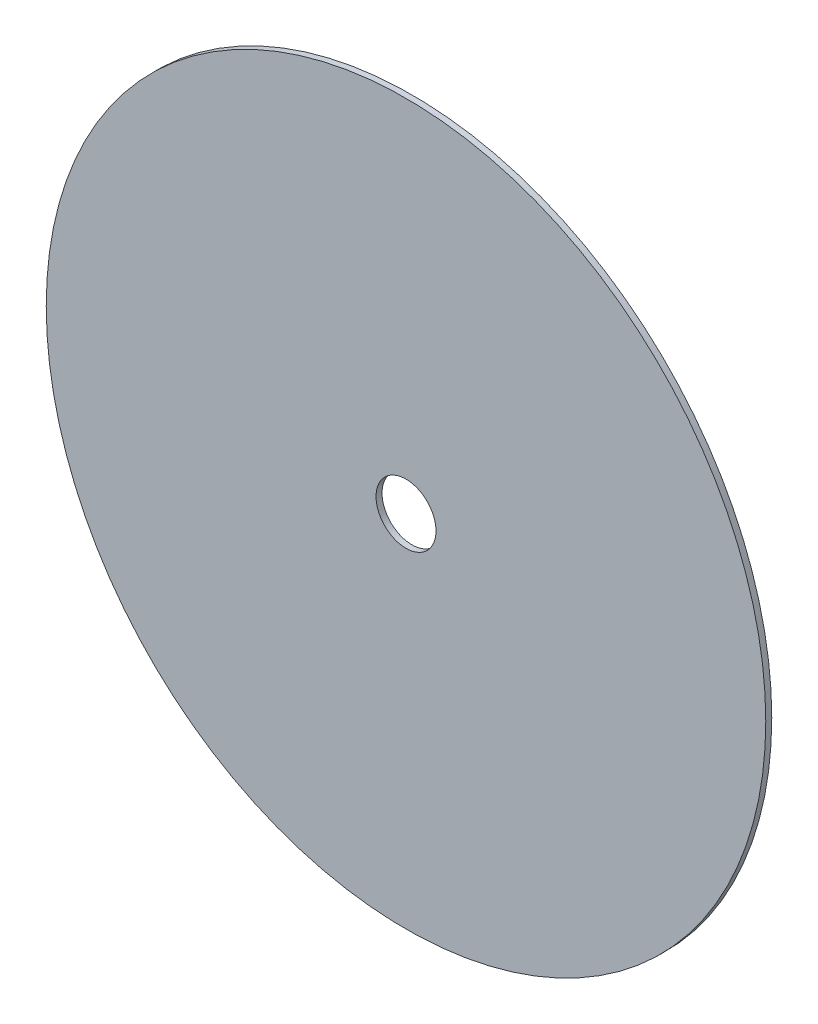
ISO-10303-21;
HEADER;
FILE_DESCRIPTION(('STEP AP214'),'2;1');
FILE_NAME('part.step','',(''),(''),'','','');
FILE_SCHEMA(('AUTOMOTIVE_DESIGN { 1 0 10303 214 1 1 1 1 }'));
ENDSEC;
DATA;
#1=APPLICATION_CONTEXT('core data for automotive mechanical design processes');
#2=APPLICATION_PROTOCOL_DEFINITION('international standard','automotive_design',2000,#1);
#3=PRODUCT_CONTEXT('',#1,'mechanical');
#4=PRODUCT('Part','Part','',(#3));
#5=PRODUCT_RELATED_PRODUCT_CATEGORY('part','',(#4));
#6=PRODUCT_DEFINITION_FORMATION('','',#4);
#7=PRODUCT_DEFINITION_CONTEXT('part definition',#1,'design');
#8=PRODUCT_DEFINITION('design','',#6,#7);
#9=PRODUCT_DEFINITION_SHAPE('','',#8);
#10=(LENGTH_UNIT() NAMED_UNIT(*) SI_UNIT(.MILLI.,.METRE.));
#11=(NAMED_UNIT(*) PLANE_ANGLE_UNIT() SI_UNIT($,.RADIAN.));
#12=(NAMED_UNIT(*) SI_UNIT($,.STERADIAN.) SOLID_ANGLE_UNIT());
#13=UNCERTAINTY_MEASURE_WITH_UNIT(LENGTH_MEASURE(1.E-05),#10,'distance_accuracy_value','');
#14=(GEOMETRIC_REPRESENTATION_CONTEXT(3) GLOBAL_UNCERTAINTY_ASSIGNED_CONTEXT((#13)) GLOBAL_UNIT_ASSIGNED_CONTEXT((#10,
#11,#12)) REPRESENTATION_CONTEXT('',''));
#15=CARTESIAN_POINT('',(0.,0.,0.));
#16=DIRECTION('',(0.,0.,1.));
#17=DIRECTION('',(1.,0.,0.));
#18=AXIS2_PLACEMENT_3D('',#15,#16,#17);
#19=CARTESIAN_POINT('',(0.,0.,2.54));
#20=DIRECTION('',(0.,0.,-1.));
#21=DIRECTION('',(-1.,0.,0.));
#22=AXIS2_PLACEMENT_3D('',#19,#20,#21);
#23=CYLINDRICAL_SURFACE('',#22,152.4);
#24=CARTESIAN_POINT('',(0.,0.,2.54));
#25=DIRECTION('',(0.,0.,1.));
#26=DIRECTION('',(1.,0.,0.));
#27=AXIS2_PLACEMENT_3D('',#24,#25,#26);
#28=CIRCLE('',#27,152.4);
#29=CARTESIAN_POINT('',(152.4,0.,2.54));
#30=VERTEX_POINT('',#29);
#31=EDGE_CURVE('E10',#30,#30,#28,.T.);
#32=ORIENTED_EDGE('',*,*,#31,.F.);
#33=EDGE_LOOP('',(#32));
#34=FACE_BOUND('',#33,.T.);
#35=CARTESIAN_POINT('',(0.,0.,0.));
#36=DIRECTION('',(0.,0.,1.));
#37=DIRECTION('',(1.,0.,0.));
#38=AXIS2_PLACEMENT_3D('',#35,#36,#37);
#39=CIRCLE('',#38,152.4);
#40=CARTESIAN_POINT('',(152.4,0.,0.));
#41=VERTEX_POINT('',#40);
#42=EDGE_CURVE('E33',#41,#41,#39,.T.);
#43=ORIENTED_EDGE('',*,*,#42,.T.);
#44=EDGE_LOOP('',(#43));
#45=FACE_BOUND('',#44,.T.);
#46=ADVANCED_FACE('F30',(#34,#45),#23,.T.);
#47=CARTESIAN_POINT('',(0.,0.,2.54));
#48=DIRECTION('',(0.,0.,1.));
#49=DIRECTION('',(1.,0.,0.));
#50=AXIS2_PLACEMENT_3D('',#47,#48,#49);
#51=PLANE('',#50);
#52=CARTESIAN_POINT('',(0.,0.,2.54));
#53=DIRECTION('',(0.,0.,1.));
#54=DIRECTION('',(1.,0.,0.));
#55=AXIS2_PLACEMENT_3D('',#52,#53,#54);
#56=CIRCLE('',#55,12.7);
#57=CARTESIAN_POINT('',(12.7,0.,2.54));
#58=VERTEX_POINT('',#57);
#59=EDGE_CURVE('E42',#58,#58,#56,.T.);
#60=ORIENTED_EDGE('',*,*,#59,.F.);
#61=EDGE_LOOP('',(#60));
#62=FACE_BOUND('',#61,.T.);
#63=ORIENTED_EDGE('',*,*,#31,.T.);
#64=EDGE_LOOP('',(#63));
#65=FACE_BOUND('',#64,.T.);
#66=ADVANCED_FACE('F57',(#62,#65),#51,.T.);
#67=CARTESIAN_POINT('',(0.,0.,0.));
#68=DIRECTION('',(0.,0.,1.));
#69=DIRECTION('',(1.,0.,0.));
#70=AXIS2_PLACEMENT_3D('',#67,#68,#69);
#71=PLANE('',#70);
#72=CARTESIAN_POINT('',(0.,0.,0.));
#73=DIRECTION('',(0.,0.,1.));
#74=DIRECTION('',(1.,0.,0.));
#75=AXIS2_PLACEMENT_3D('',#72,#73,#74);
#76=CIRCLE('',#75,12.7);
#77=CARTESIAN_POINT('',(12.7,0.,0.));
#78=VERTEX_POINT('',#77);
#79=EDGE_CURVE('E40',#78,#78,#76,.T.);
#80=ORIENTED_EDGE('',*,*,#79,.T.);
#81=EDGE_LOOP('',(#80));
#82=FACE_BOUND('',#81,.T.);
#83=ORIENTED_EDGE('',*,*,#42,.F.);
#84=EDGE_LOOP('',(#83));
#85=FACE_BOUND('',#84,.T.);
#86=ADVANCED_FACE('F48',(#82,#85),#71,.F.);
#87=CARTESIAN_POINT('',(0.,0.,0.));
#88=DIRECTION('',(0.,0.,1.));
#89=DIRECTION('',(1.,0.,0.));
#90=AXIS2_PLACEMENT_3D('',#87,#88,#89);
#91=CYLINDRICAL_SURFACE('',#90,12.7);
#92=ORIENTED_EDGE('',*,*,#79,.F.);
#93=EDGE_LOOP('',(#92));
#94=FACE_BOUND('',#93,.T.);
#95=ORIENTED_EDGE('',*,*,#59,.T.);
#96=EDGE_LOOP('',(#95));
#97=FACE_BOUND('',#96,.T.);
#98=ADVANCED_FACE('F51',(#94,#97),#91,.F.);
#99=CLOSED_SHELL('',(#46,#66,#86,#98));
#100=MANIFOLD_SOLID_BREP('B2',#99);
#101=ADVANCED_BREP_SHAPE_REPRESENTATION('',(#18,#100),#14);
#102=SHAPE_DEFINITION_REPRESENTATION(#9,#101);
ENDSEC;
END-ISO-10303-21;
